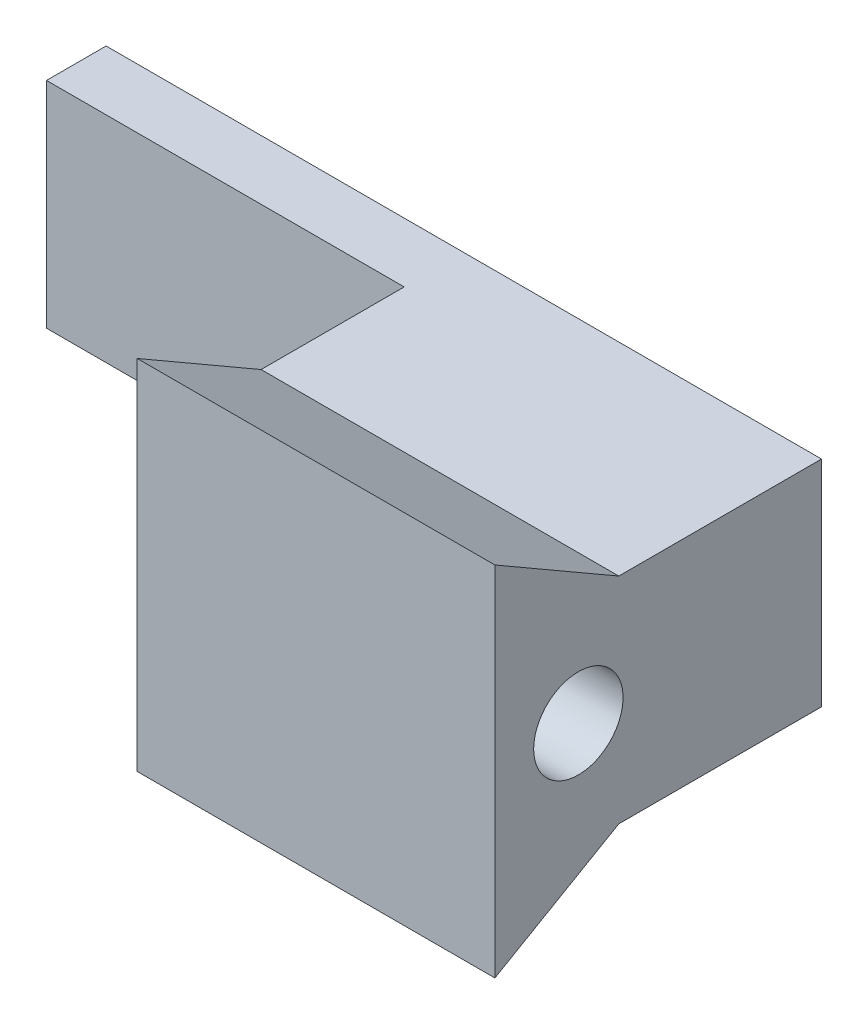
ISO-10303-21;
HEADER;
FILE_DESCRIPTION(('STEP AP214'),'2;1');
FILE_NAME('part.step','',(''),(''),'','','');
FILE_SCHEMA(('AUTOMOTIVE_DESIGN { 1 0 10303 214 1 1 1 1 }'));
ENDSEC;
DATA;
#1=APPLICATION_CONTEXT('core data for automotive mechanical design processes');
#2=APPLICATION_PROTOCOL_DEFINITION('international standard','automotive_design',2000,#1);
#3=PRODUCT_CONTEXT('',#1,'mechanical');
#4=PRODUCT('Part','Part','',(#3));
#5=PRODUCT_RELATED_PRODUCT_CATEGORY('part','',(#4));
#6=PRODUCT_DEFINITION_FORMATION('','',#4);
#7=PRODUCT_DEFINITION_CONTEXT('part definition',#1,'design');
#8=PRODUCT_DEFINITION('design','',#6,#7);
#9=PRODUCT_DEFINITION_SHAPE('','',#8);
#10=(LENGTH_UNIT() NAMED_UNIT(*) SI_UNIT(.MILLI.,.METRE.));
#11=(NAMED_UNIT(*) PLANE_ANGLE_UNIT() SI_UNIT($,.RADIAN.));
#12=(NAMED_UNIT(*) SI_UNIT($,.STERADIAN.) SOLID_ANGLE_UNIT());
#13=UNCERTAINTY_MEASURE_WITH_UNIT(LENGTH_MEASURE(1.E-05),#10,'distance_accuracy_value','');
#14=(GEOMETRIC_REPRESENTATION_CONTEXT(3) GLOBAL_UNCERTAINTY_ASSIGNED_CONTEXT((#13)) GLOBAL_UNIT_ASSIGNED_CONTEXT((#10,
#11,#12)) REPRESENTATION_CONTEXT('',''));
#15=CARTESIAN_POINT('',(0.,0.,0.));
#16=DIRECTION('',(0.,0.,1.));
#17=DIRECTION('',(1.,0.,0.));
#18=AXIS2_PLACEMENT_3D('',#15,#16,#17);
#19=CARTESIAN_POINT('',(0.,0.,0.));
#20=DIRECTION('',(1.,0.,0.));
#21=DIRECTION('',(0.,0.,-1.));
#22=AXIS2_PLACEMENT_3D('',#19,#20,#21);
#23=PLANE('',#22);
#24=CARTESIAN_POINT('',(0.,0.,-0.7));
#25=DIRECTION('',(-1.,0.,0.));
#26=DIRECTION('',(0.,0.,1.));
#27=AXIS2_PLACEMENT_3D('',#24,#25,#26);
#28=CIRCLE('',#27,0.375);
#29=CARTESIAN_POINT('',(0.,0.,-0.325));
#30=VERTEX_POINT('',#29);
#31=EDGE_CURVE('E199',#30,#30,#28,.T.);
#32=ORIENTED_EDGE('',*,*,#31,.F.);
#33=EDGE_LOOP('',(#32));
#34=FACE_BOUND('',#33,.T.);
#35=DIRECTION('',(0.,1.,0.));
#36=VECTOR('',#35,1.);
#37=CARTESIAN_POINT('',(0.,0.,-2.23923048454132));
#38=LINE('',#37,#36);
#39=CARTESIAN_POINT('',(0.,-0.900000000000001,-2.23923048454131));
#40=VERTEX_POINT('',#39);
#41=CARTESIAN_POINT('',(0.,0.899999999999999,-2.23923048454132));
#42=VERTEX_POINT('',#41);
#43=EDGE_CURVE('E59',#40,#42,#38,.T.);
#44=ORIENTED_EDGE('',*,*,#43,.F.);
#45=DIRECTION('',(0.,0.,-1.));
#46=VECTOR('',#45,1.);
#47=CARTESIAN_POINT('',(0.,-0.900000000000001,0.));
#48=LINE('',#47,#46);
#49=CARTESIAN_POINT('',(0.,-0.900000000000001,-1.03923048454131));
#50=VERTEX_POINT('',#49);
#51=EDGE_CURVE('E137',#50,#40,#48,.T.);
#52=ORIENTED_EDGE('',*,*,#51,.F.);
#53=DIRECTION('',(0.,-0.500000000000004,0.866025403784436));
#54=VECTOR('',#53,1.);
#55=CARTESIAN_POINT('',(0.,-1.12499999999999,-0.649519052838333));
#56=LINE('',#55,#54);
#57=CARTESIAN_POINT('',(0.,-1.5,0.));
#58=VERTEX_POINT('',#57);
#59=EDGE_CURVE('E149',#50,#58,#56,.T.);
#60=ORIENTED_EDGE('',*,*,#59,.T.);
#61=DIRECTION('',(0.,1.,0.));
#62=VECTOR('',#61,1.);
#63=CARTESIAN_POINT('',(0.,0.,0.));
#64=LINE('',#63,#62);
#65=CARTESIAN_POINT('',(0.,1.5,0.));
#66=VERTEX_POINT('',#65);
#67=EDGE_CURVE('E146',#58,#66,#64,.T.);
#68=ORIENTED_EDGE('',*,*,#67,.T.);
#69=DIRECTION('',(0.,-0.500000000000005,-0.866025403784436));
#70=VECTOR('',#69,1.);
#71=CARTESIAN_POINT('',(0.,1.12499999999999,-0.649519052838333));
#72=LINE('',#71,#70);
#73=CARTESIAN_POINT('',(0.,0.899999999999999,-1.03923048454132));
#74=VERTEX_POINT('',#73);
#75=EDGE_CURVE('E112',#66,#74,#72,.T.);
#76=ORIENTED_EDGE('',*,*,#75,.T.);
#77=DIRECTION('',(0.,0.,-1.));
#78=VECTOR('',#77,1.);
#79=CARTESIAN_POINT('',(0.,0.899999999999999,0.));
#80=LINE('',#79,#78);
#81=EDGE_CURVE('E140',#74,#42,#80,.T.);
#82=ORIENTED_EDGE('',*,*,#81,.T.);
#83=EDGE_LOOP('',(#44,#52,#60,#68,#76,#82));
#84=FACE_BOUND('',#83,.T.);
#85=ADVANCED_FACE('F43',(#34,#84),#23,.F.);
#86=CARTESIAN_POINT('',(3.,-0.900000000000001,0.));
#87=DIRECTION('',(0.,1.,0.));
#88=DIRECTION('',(0.,0.,1.));
#89=AXIS2_PLACEMENT_3D('',#86,#87,#88);
#90=PLANE('',#89);
#91=ORIENTED_EDGE('',*,*,#51,.T.);
#92=DIRECTION('',(1.,0.,0.));
#93=VECTOR('',#92,1.);
#94=CARTESIAN_POINT('',(-3.,-0.900000000000001,-2.23923048454131));
#95=LINE('',#94,#93);
#96=CARTESIAN_POINT('',(-3.,-0.900000000000001,-2.23923048454131));
#97=VERTEX_POINT('',#96);
#98=EDGE_CURVE('E188',#97,#40,#95,.T.);
#99=ORIENTED_EDGE('',*,*,#98,.F.);
#100=DIRECTION('',(0.,0.,1.));
#101=VECTOR('',#100,1.);
#102=CARTESIAN_POINT('',(-3.,-0.900000000000005,0.));
#103=LINE('',#102,#101);
#104=CARTESIAN_POINT('',(-3.,-0.9,-2.73923048454132));
#105=VERTEX_POINT('',#104);
#106=EDGE_CURVE('E180',#105,#97,#103,.T.);
#107=ORIENTED_EDGE('',*,*,#106,.F.);
#108=DIRECTION('',(-1.,0.,0.));
#109=VECTOR('',#108,1.);
#110=CARTESIAN_POINT('',(3.,-0.9,-2.73923048454132));
#111=LINE('',#110,#109);
#112=CARTESIAN_POINT('',(3.,-0.9,-2.73923048454132));
#113=VERTEX_POINT('',#112);
#114=EDGE_CURVE('E11',#113,#105,#111,.T.);
#115=ORIENTED_EDGE('',*,*,#114,.F.);
#116=DIRECTION('',(0.,0.,-1.));
#117=VECTOR('',#116,1.);
#118=CARTESIAN_POINT('',(3.,-0.900000000000001,0.));
#119=LINE('',#118,#117);
#120=CARTESIAN_POINT('',(3.,-0.900000000000001,-1.03923048454131));
#121=VERTEX_POINT('',#120);
#122=EDGE_CURVE('E93',#121,#113,#119,.T.);
#123=ORIENTED_EDGE('',*,*,#122,.F.);
#124=DIRECTION('',(-1.,0.,0.));
#125=VECTOR('',#124,1.);
#126=CARTESIAN_POINT('',(3.,-0.900000000000001,-1.03923048454131));
#127=LINE('',#126,#125);
#128=EDGE_CURVE('E68',#121,#50,#127,.T.);
#129=ORIENTED_EDGE('',*,*,#128,.T.);
#130=EDGE_LOOP('',(#91,#99,#107,#115,#123,#129));
#131=FACE_BOUND('',#130,.T.);
#132=ADVANCED_FACE('F45',(#131),#90,.F.);
#133=CARTESIAN_POINT('',(3.,0.,-2.73923048454132));
#134=DIRECTION('',(0.,0.,-1.));
#135=DIRECTION('',(0.,1.,0.));
#136=AXIS2_PLACEMENT_3D('',#133,#134,#135);
#137=PLANE('',#136);
#138=ORIENTED_EDGE('',*,*,#114,.T.);
#139=DIRECTION('',(0.,-1.,0.));
#140=VECTOR('',#139,1.);
#141=CARTESIAN_POINT('',(-3.,0.,-2.73923048454132));
#142=LINE('',#141,#140);
#143=CARTESIAN_POINT('',(-3.,0.9,-2.73923048454132));
#144=VERTEX_POINT('',#143);
#145=EDGE_CURVE('E174',#144,#105,#142,.T.);
#146=ORIENTED_EDGE('',*,*,#145,.F.);
#147=DIRECTION('',(-1.,0.,0.));
#148=VECTOR('',#147,1.);
#149=CARTESIAN_POINT('',(3.,0.9,-2.73923048454132));
#150=LINE('',#149,#148);
#151=CARTESIAN_POINT('',(3.,0.9,-2.73923048454132));
#152=VERTEX_POINT('',#151);
#153=EDGE_CURVE('E52',#152,#144,#150,.T.);
#154=ORIENTED_EDGE('',*,*,#153,.F.);
#155=DIRECTION('',(0.,-1.,0.));
#156=VECTOR('',#155,1.);
#157=CARTESIAN_POINT('',(3.,0.,-2.73923048454132));
#158=LINE('',#157,#156);
#159=EDGE_CURVE('E209',#152,#113,#158,.T.);
#160=ORIENTED_EDGE('',*,*,#159,.T.);
#161=EDGE_LOOP('',(#138,#146,#154,#160));
#162=FACE_BOUND('',#161,.T.);
#163=ADVANCED_FACE('F175',(#162),#137,.T.);
#164=CARTESIAN_POINT('',(3.,0.899999999999999,0.));
#165=DIRECTION('',(0.,1.,0.));
#166=DIRECTION('',(0.,0.,1.));
#167=AXIS2_PLACEMENT_3D('',#164,#165,#166);
#168=PLANE('',#167);
#169=ORIENTED_EDGE('',*,*,#81,.F.);
#170=DIRECTION('',(-1.,0.,0.));
#171=VECTOR('',#170,1.);
#172=CARTESIAN_POINT('',(3.,0.899999999999999,-1.03923048454132));
#173=LINE('',#172,#171);
#174=CARTESIAN_POINT('',(3.,0.899999999999999,-1.03923048454132));
#175=VERTEX_POINT('',#174);
#176=EDGE_CURVE('E118',#175,#74,#173,.T.);
#177=ORIENTED_EDGE('',*,*,#176,.F.);
#178=DIRECTION('',(0.,0.,-1.));
#179=VECTOR('',#178,1.);
#180=CARTESIAN_POINT('',(3.,0.899999999999999,0.));
#181=LINE('',#180,#179);
#182=EDGE_CURVE('E126',#175,#152,#181,.T.);
#183=ORIENTED_EDGE('',*,*,#182,.T.);
#184=ORIENTED_EDGE('',*,*,#153,.T.);
#185=DIRECTION('',(0.,0.,1.));
#186=VECTOR('',#185,1.);
#187=CARTESIAN_POINT('',(-3.,0.899999999999996,0.));
#188=LINE('',#187,#186);
#189=CARTESIAN_POINT('',(-3.,0.899999999999999,-2.23923048454132));
#190=VERTEX_POINT('',#189);
#191=EDGE_CURVE('E168',#144,#190,#188,.T.);
#192=ORIENTED_EDGE('',*,*,#191,.T.);
#193=DIRECTION('',(1.,0.,0.));
#194=VECTOR('',#193,1.);
#195=CARTESIAN_POINT('',(-3.,0.899999999999999,-2.23923048454132));
#196=LINE('',#195,#194);
#197=EDGE_CURVE('E192',#190,#42,#196,.T.);
#198=ORIENTED_EDGE('',*,*,#197,.T.);
#199=EDGE_LOOP('',(#169,#177,#183,#184,#192,#198));
#200=FACE_BOUND('',#199,.T.);
#201=ADVANCED_FACE('F165',(#200),#168,.T.);
#202=CARTESIAN_POINT('',(3.,1.12499999999999,-0.649519052838333));
#203=DIRECTION('',(0.,0.866025403784436,-0.500000000000004));
#204=DIRECTION('',(0.,0.500000000000004,0.866025403784436));
#205=AXIS2_PLACEMENT_3D('',#202,#203,#204);
#206=PLANE('',#205);
#207=ORIENTED_EDGE('',*,*,#75,.F.);
#208=DIRECTION('',(-1.,0.,0.));
#209=VECTOR('',#208,1.);
#210=CARTESIAN_POINT('',(3.,1.5,0.));
#211=LINE('',#210,#209);
#212=CARTESIAN_POINT('',(3.,1.5,0.));
#213=VERTEX_POINT('',#212);
#214=EDGE_CURVE('E107',#213,#66,#211,.T.);
#215=ORIENTED_EDGE('',*,*,#214,.F.);
#216=DIRECTION('',(0.,-0.500000000000005,-0.866025403784436));
#217=VECTOR('',#216,1.);
#218=CARTESIAN_POINT('',(3.,1.12499999999999,-0.649519052838333));
#219=LINE('',#218,#217);
#220=EDGE_CURVE('E110',#213,#175,#219,.T.);
#221=ORIENTED_EDGE('',*,*,#220,.T.);
#222=ORIENTED_EDGE('',*,*,#176,.T.);
#223=EDGE_LOOP('',(#207,#215,#221,#222));
#224=FACE_BOUND('',#223,.T.);
#225=ADVANCED_FACE('F109',(#224),#206,.T.);
#226=CARTESIAN_POINT('',(3.,0.,0.));
#227=DIRECTION('',(0.,0.,1.));
#228=DIRECTION('',(0.,-1.,0.));
#229=AXIS2_PLACEMENT_3D('',#226,#227,#228);
#230=PLANE('',#229);
#231=ORIENTED_EDGE('',*,*,#67,.F.);
#232=DIRECTION('',(-1.,0.,0.));
#233=VECTOR('',#232,1.);
#234=CARTESIAN_POINT('',(3.,-1.5,0.));
#235=LINE('',#234,#233);
#236=CARTESIAN_POINT('',(3.,-1.5,0.));
#237=VERTEX_POINT('',#236);
#238=EDGE_CURVE('E119',#237,#58,#235,.T.);
#239=ORIENTED_EDGE('',*,*,#238,.F.);
#240=DIRECTION('',(0.,1.,0.));
#241=VECTOR('',#240,1.);
#242=CARTESIAN_POINT('',(3.,0.,0.));
#243=LINE('',#242,#241);
#244=EDGE_CURVE('E124',#237,#213,#243,.T.);
#245=ORIENTED_EDGE('',*,*,#244,.T.);
#246=ORIENTED_EDGE('',*,*,#214,.T.);
#247=EDGE_LOOP('',(#231,#239,#245,#246));
#248=FACE_BOUND('',#247,.T.);
#249=ADVANCED_FACE('F129',(#248),#230,.T.);
#250=CARTESIAN_POINT('',(3.,-1.12499999999999,-0.649519052838333));
#251=DIRECTION('',(0.,-0.866025403784436,-0.500000000000004));
#252=DIRECTION('',(0.,0.500000000000004,-0.866025403784436));
#253=AXIS2_PLACEMENT_3D('',#250,#251,#252);
#254=PLANE('',#253);
#255=ORIENTED_EDGE('',*,*,#59,.F.);
#256=ORIENTED_EDGE('',*,*,#128,.F.);
#257=DIRECTION('',(0.,-0.500000000000004,0.866025403784436));
#258=VECTOR('',#257,1.);
#259=CARTESIAN_POINT('',(3.,-1.12499999999999,-0.649519052838333));
#260=LINE('',#259,#258);
#261=EDGE_CURVE('E131',#121,#237,#260,.T.);
#262=ORIENTED_EDGE('',*,*,#261,.T.);
#263=ORIENTED_EDGE('',*,*,#238,.T.);
#264=EDGE_LOOP('',(#255,#256,#262,#263));
#265=FACE_BOUND('',#264,.T.);
#266=ADVANCED_FACE('F229',(#265),#254,.T.);
#267=CARTESIAN_POINT('',(3.,0.,0.));
#268=DIRECTION('',(1.,0.,0.));
#269=DIRECTION('',(0.,0.,-1.));
#270=AXIS2_PLACEMENT_3D('',#267,#268,#269);
#271=PLANE('',#270);
#272=CARTESIAN_POINT('',(3.,0.,-0.7));
#273=DIRECTION('',(-1.,0.,0.));
#274=DIRECTION('',(0.,0.,1.));
#275=AXIS2_PLACEMENT_3D('',#272,#273,#274);
#276=CIRCLE('',#275,0.374999999999999);
#277=CARTESIAN_POINT('',(3.,0.,-0.325000000000001));
#278=VERTEX_POINT('',#277);
#279=EDGE_CURVE('E141',#278,#278,#276,.T.);
#280=ORIENTED_EDGE('',*,*,#279,.T.);
#281=EDGE_LOOP('',(#280));
#282=FACE_BOUND('',#281,.T.);
#283=ORIENTED_EDGE('',*,*,#122,.T.);
#284=ORIENTED_EDGE('',*,*,#159,.F.);
#285=ORIENTED_EDGE('',*,*,#182,.F.);
#286=ORIENTED_EDGE('',*,*,#220,.F.);
#287=ORIENTED_EDGE('',*,*,#244,.F.);
#288=ORIENTED_EDGE('',*,*,#261,.F.);
#289=EDGE_LOOP('',(#283,#284,#285,#286,#287,#288));
#290=FACE_BOUND('',#289,.T.);
#291=ADVANCED_FACE('F123',(#282,#290),#271,.T.);
#292=CARTESIAN_POINT('',(0.,0.,-0.7));
#293=DIRECTION('',(-1.,0.,0.));
#294=DIRECTION('',(0.,0.,1.));
#295=AXIS2_PLACEMENT_3D('',#292,#293,#294);
#296=CYLINDRICAL_SURFACE('',#295,0.374999999999999);
#297=ORIENTED_EDGE('',*,*,#279,.F.);
#298=EDGE_LOOP('',(#297));
#299=FACE_BOUND('',#298,.T.);
#300=ORIENTED_EDGE('',*,*,#31,.T.);
#301=EDGE_LOOP('',(#300));
#302=FACE_BOUND('',#301,.T.);
#303=ADVANCED_FACE('F215',(#299,#302),#296,.F.);
#304=CARTESIAN_POINT('',(-3.,0.,-2.23923048454132));
#305=DIRECTION('',(0.,0.,-1.));
#306=DIRECTION('',(-1.,0.,0.));
#307=AXIS2_PLACEMENT_3D('',#304,#305,#306);
#308=PLANE('',#307);
#309=ORIENTED_EDGE('',*,*,#43,.T.);
#310=ORIENTED_EDGE('',*,*,#197,.F.);
#311=DIRECTION('',(0.,1.,0.));
#312=VECTOR('',#311,1.);
#313=CARTESIAN_POINT('',(-3.,0.,-2.23923048454132));
#314=LINE('',#313,#312);
#315=EDGE_CURVE('E185',#97,#190,#314,.T.);
#316=ORIENTED_EDGE('',*,*,#315,.F.);
#317=ORIENTED_EDGE('',*,*,#98,.T.);
#318=EDGE_LOOP('',(#309,#310,#316,#317));
#319=FACE_BOUND('',#318,.T.);
#320=ADVANCED_FACE('F218',(#319),#308,.F.);
#321=CARTESIAN_POINT('',(-3.,0.,0.));
#322=DIRECTION('',(1.,0.,0.));
#323=DIRECTION('',(0.,0.,-1.));
#324=AXIS2_PLACEMENT_3D('',#321,#322,#323);
#325=PLANE('',#324);
#326=ORIENTED_EDGE('',*,*,#315,.T.);
#327=ORIENTED_EDGE('',*,*,#191,.F.);
#328=ORIENTED_EDGE('',*,*,#145,.T.);
#329=ORIENTED_EDGE('',*,*,#106,.T.);
#330=EDGE_LOOP('',(#326,#327,#328,#329));
#331=FACE_BOUND('',#330,.T.);
#332=ADVANCED_FACE('F183',(#331),#325,.F.);
#333=CLOSED_SHELL('',(#85,#132,#163,#201,#225,#249,#266,#291,#303,#320,#332));
#334=MANIFOLD_SOLID_BREP('B2',#333);
#335=ADVANCED_BREP_SHAPE_REPRESENTATION('',(#18,#334),#14);
#336=SHAPE_DEFINITION_REPRESENTATION(#9,#335);
ENDSEC;
END-ISO-10303-21;
